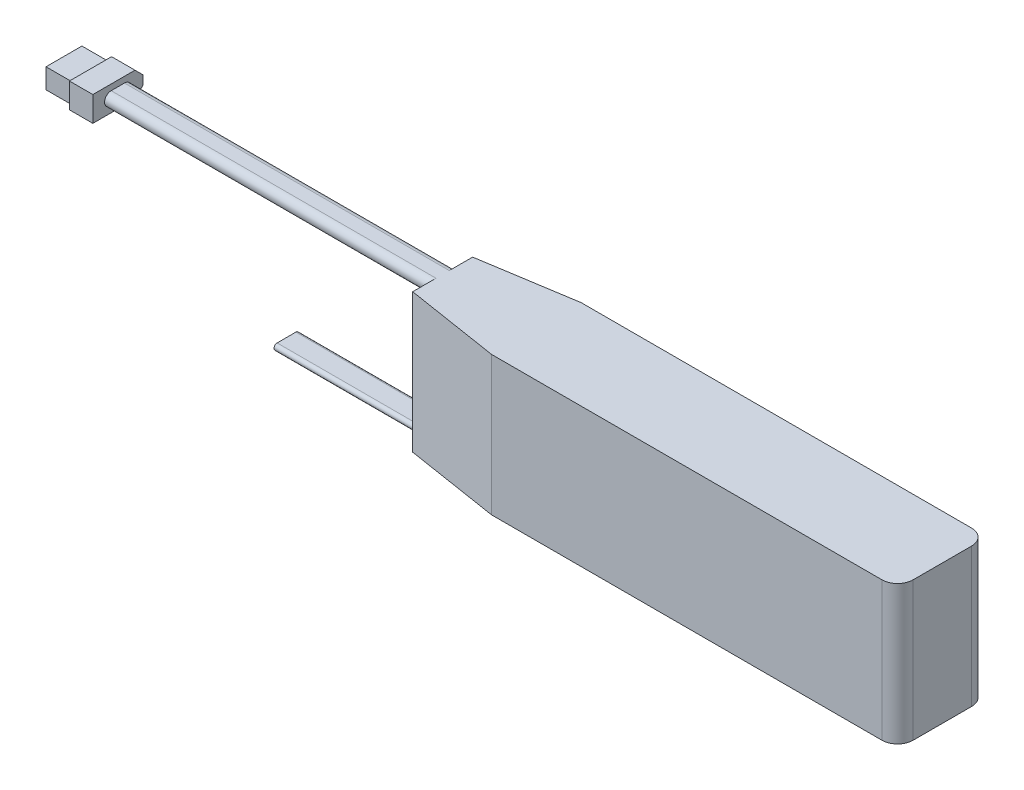
ISO-10303-21;
HEADER;
FILE_DESCRIPTION(('STEP AP214'),'2;1');
FILE_NAME('part.step','',(''),(''),'','','');
FILE_SCHEMA(('AUTOMOTIVE_DESIGN { 1 0 10303 214 1 1 1 1 }'));
ENDSEC;
DATA;
#1=APPLICATION_CONTEXT('core data for automotive mechanical design processes');
#2=APPLICATION_PROTOCOL_DEFINITION('international standard','automotive_design',2000,#1);
#3=PRODUCT_CONTEXT('',#1,'mechanical');
#4=PRODUCT('Part','Part','',(#3));
#5=PRODUCT_RELATED_PRODUCT_CATEGORY('part','',(#4));
#6=PRODUCT_DEFINITION_FORMATION('','',#4);
#7=PRODUCT_DEFINITION_CONTEXT('part definition',#1,'design');
#8=PRODUCT_DEFINITION('design','',#6,#7);
#9=PRODUCT_DEFINITION_SHAPE('','',#8);
#10=(LENGTH_UNIT() NAMED_UNIT(*) SI_UNIT(.MILLI.,.METRE.));
#11=(NAMED_UNIT(*) PLANE_ANGLE_UNIT() SI_UNIT($,.RADIAN.));
#12=(NAMED_UNIT(*) SI_UNIT($,.STERADIAN.) SOLID_ANGLE_UNIT());
#13=UNCERTAINTY_MEASURE_WITH_UNIT(LENGTH_MEASURE(1.E-05),#10,'distance_accuracy_value','');
#14=(GEOMETRIC_REPRESENTATION_CONTEXT(3) GLOBAL_UNCERTAINTY_ASSIGNED_CONTEXT((#13)) GLOBAL_UNIT_ASSIGNED_CONTEXT((#10,
#11,#12)) REPRESENTATION_CONTEXT('',''));
#15=CARTESIAN_POINT('',(0.,0.,0.));
#16=DIRECTION('',(0.,0.,1.));
#17=DIRECTION('',(1.,0.,0.));
#18=AXIS2_PLACEMENT_3D('',#15,#16,#17);
#19=CARTESIAN_POINT('',(-120.,40.25,0.));
#20=DIRECTION('',(0.,1.,0.));
#21=DIRECTION('',(0.,0.,1.));
#22=AXIS2_PLACEMENT_3D('',#19,#20,#21);
#23=PLANE('',#22);
#24=DIRECTION('',(0.,0.,1.));
#25=VECTOR('',#24,1.);
#26=CARTESIAN_POINT('',(-111.5,40.25,0.));
#27=LINE('',#26,#25);
#28=CARTESIAN_POINT('',(-111.5,40.25,14.1166529602516));
#29=VERTEX_POINT('',#28);
#30=CARTESIAN_POINT('',(-111.5,40.25,14.7460280231663));
#31=VERTEX_POINT('',#30);
#32=EDGE_CURVE('E378',#29,#31,#27,.T.);
#33=ORIENTED_EDGE('',*,*,#32,.T.);
#34=DIRECTION('',(-1.,0.,0.));
#35=VECTOR('',#34,1.);
#36=CARTESIAN_POINT('',(-120.,40.25,14.7460280231663));
#37=LINE('',#36,#35);
#38=CARTESIAN_POINT('',(-120.,40.25,14.7460280231663));
#39=VERTEX_POINT('',#38);
#40=EDGE_CURVE('E11',#31,#39,#37,.T.);
#41=ORIENTED_EDGE('',*,*,#40,.T.);
#42=DIRECTION('',(0.,0.,1.));
#43=VECTOR('',#42,1.);
#44=CARTESIAN_POINT('',(-120.,40.25,0.));
#45=LINE('',#44,#43);
#46=CARTESIAN_POINT('',(-120.,40.25,14.1166529602516));
#47=VERTEX_POINT('',#46);
#48=EDGE_CURVE('E262',#47,#39,#45,.T.);
#49=ORIENTED_EDGE('',*,*,#48,.F.);
#50=DIRECTION('',(-1.,0.,0.));
#51=VECTOR('',#50,1.);
#52=CARTESIAN_POINT('',(-120.,40.25,14.1166529602516));
#53=LINE('',#52,#51);
#54=EDGE_CURVE('E41',#29,#47,#53,.T.);
#55=ORIENTED_EDGE('',*,*,#54,.F.);
#56=EDGE_LOOP('',(#33,#41,#49,#55));
#57=FACE_BOUND('',#56,.T.);
#58=ADVANCED_FACE('F33',(#57),#23,.F.);
#59=CARTESIAN_POINT('',(0.,44.5,28.7));
#60=DIRECTION('',(0.,-1.,0.));
#61=DIRECTION('',(0.,0.,-1.));
#62=AXIS2_PLACEMENT_3D('',#59,#60,#61);
#63=PLANE('',#62);
#64=DIRECTION('',(0.,0.,-1.));
#65=VECTOR('',#64,1.);
#66=CARTESIAN_POINT('',(-104.,44.5,28.7));
#67=LINE('',#66,#65);
#68=CARTESIAN_POINT('',(-104.,44.5,16.475));
#69=VERTEX_POINT('',#68);
#70=CARTESIAN_POINT('',(-104.,44.5,12.225));
#71=VERTEX_POINT('',#70);
#72=EDGE_CURVE('E372',#69,#71,#67,.T.);
#73=ORIENTED_EDGE('',*,*,#72,.F.);
#74=DIRECTION('',(1.,0.,0.));
#75=VECTOR('',#74,1.);
#76=CARTESIAN_POINT('',(-120.,44.5,16.475));
#77=LINE('',#76,#75);
#78=CARTESIAN_POINT('',(0.,44.5,16.475));
#79=VERTEX_POINT('',#78);
#80=EDGE_CURVE('E422',#69,#79,#77,.T.);
#81=ORIENTED_EDGE('',*,*,#80,.T.);
#82=DIRECTION('',(0.,0.,-1.));
#83=VECTOR('',#82,1.);
#84=CARTESIAN_POINT('',(0.,44.5,28.7));
#85=LINE('',#84,#83);
#86=CARTESIAN_POINT('',(0.,44.5,23.9484667902639));
#87=VERTEX_POINT('',#86);
#88=EDGE_CURVE('E437',#87,#79,#85,.T.);
#89=ORIENTED_EDGE('',*,*,#88,.F.);
#90=DIRECTION('',(-0.987688340595138,0.,-0.156434465040229));
#91=VECTOR('',#90,1.);
#92=CARTESIAN_POINT('',(30.0000000000007,44.5,28.7));
#93=LINE('',#92,#91);
#94=CARTESIAN_POINT('',(30.0000000000007,44.5,28.7));
#95=VERTEX_POINT('',#94);
#96=EDGE_CURVE('E485',#87,#95,#93,.F.);
#97=ORIENTED_EDGE('',*,*,#96,.T.);
#98=DIRECTION('',(-1.,0.,0.));
#99=VECTOR('',#98,1.);
#100=CARTESIAN_POINT('',(0.,44.5,28.7));
#101=LINE('',#100,#99);
#102=CARTESIAN_POINT('',(155.,44.5,28.7));
#103=VERTEX_POINT('',#102);
#104=EDGE_CURVE('E429',#103,#95,#101,.T.);
#105=ORIENTED_EDGE('',*,*,#104,.F.);
#106=CARTESIAN_POINT('',(155.,44.5,23.7));
#107=DIRECTION('',(0.,-1.,0.));
#108=DIRECTION('',(0.,0.,-1.));
#109=AXIS2_PLACEMENT_3D('',#106,#107,#108);
#110=CIRCLE('',#109,5.);
#111=CARTESIAN_POINT('',(160.,44.5,23.7));
#112=VERTEX_POINT('',#111);
#113=EDGE_CURVE('E455',#103,#112,#110,.F.);
#114=ORIENTED_EDGE('',*,*,#113,.T.);
#115=DIRECTION('',(0.,0.,-1.));
#116=VECTOR('',#115,1.);
#117=CARTESIAN_POINT('',(160.,44.5,28.7));
#118=LINE('',#117,#116);
#119=CARTESIAN_POINT('',(160.,44.5,5.));
#120=VERTEX_POINT('',#119);
#121=EDGE_CURVE('E440',#112,#120,#118,.T.);
#122=ORIENTED_EDGE('',*,*,#121,.T.);
#123=CARTESIAN_POINT('',(155.,44.5,5.));
#124=DIRECTION('',(0.,-1.,0.));
#125=DIRECTION('',(0.,0.,-1.));
#126=AXIS2_PLACEMENT_3D('',#123,#124,#125);
#127=CIRCLE('',#126,5.);
#128=CARTESIAN_POINT('',(155.,44.5,0.));
#129=VERTEX_POINT('',#128);
#130=EDGE_CURVE('E457',#120,#129,#127,.F.);
#131=ORIENTED_EDGE('',*,*,#130,.T.);
#132=DIRECTION('',(-1.,0.,0.));
#133=VECTOR('',#132,1.);
#134=CARTESIAN_POINT('',(0.,44.5,0.));
#135=LINE('',#134,#133);
#136=CARTESIAN_POINT('',(30.0000000000006,44.5,0.));
#137=VERTEX_POINT('',#136);
#138=EDGE_CURVE('E430',#129,#137,#135,.T.);
#139=ORIENTED_EDGE('',*,*,#138,.T.);
#140=DIRECTION('',(-0.987688340595138,0.,0.156434465040229));
#141=VECTOR('',#140,1.);
#142=CARTESIAN_POINT('',(0.,44.5,4.75153320973612));
#143=LINE('',#142,#141);
#144=CARTESIAN_POINT('',(0.,44.5,4.75153320973612));
#145=VERTEX_POINT('',#144);
#146=EDGE_CURVE('E482',#137,#145,#143,.T.);
#147=ORIENTED_EDGE('',*,*,#146,.T.);
#148=CARTESIAN_POINT('',(0.,44.5,12.225));
#149=VERTEX_POINT('',#148);
#150=EDGE_CURVE('E433',#149,#145,#85,.T.);
#151=ORIENTED_EDGE('',*,*,#150,.F.);
#152=DIRECTION('',(1.,0.,0.));
#153=VECTOR('',#152,1.);
#154=CARTESIAN_POINT('',(-120.,44.5,12.225));
#155=LINE('',#154,#153);
#156=EDGE_CURVE('E420',#71,#149,#155,.T.);
#157=ORIENTED_EDGE('',*,*,#156,.F.);
#158=EDGE_LOOP('',(#73,#81,#89,#97,#105,#114,#122,#131,#139,#147,#151,#157));
#159=FACE_BOUND('',#158,.T.);
#160=ADVANCED_FACE('F529',(#159),#63,.F.);
#161=DIRECTION('',(0.,0.,1.));
#162=VECTOR('',#161,1.);
#163=CARTESIAN_POINT('',(-104.,40.25,0.));
#164=LINE('',#163,#162);
#165=CARTESIAN_POINT('',(-104.,40.25,12.225));
#166=VERTEX_POINT('',#165);
#167=CARTESIAN_POINT('',(-104.,40.25,16.475));
#168=VERTEX_POINT('',#167);
#169=EDGE_CURVE('E370',#166,#168,#164,.T.);
#170=ORIENTED_EDGE('',*,*,#169,.F.);
#171=DIRECTION('',(1.,0.,0.));
#172=VECTOR('',#171,1.);
#173=CARTESIAN_POINT('',(-120.,40.25,12.225));
#174=LINE('',#173,#172);
#175=CARTESIAN_POINT('',(0.,40.25,12.225));
#176=VERTEX_POINT('',#175);
#177=EDGE_CURVE('E410',#166,#176,#174,.T.);
#178=ORIENTED_EDGE('',*,*,#177,.T.);
#179=DIRECTION('',(0.,0.,1.));
#180=VECTOR('',#179,1.);
#181=CARTESIAN_POINT('',(0.,40.25,0.));
#182=LINE('',#181,#180);
#183=CARTESIAN_POINT('',(0.,40.25,16.475));
#184=VERTEX_POINT('',#183);
#185=EDGE_CURVE('E408',#176,#184,#182,.T.);
#186=ORIENTED_EDGE('',*,*,#185,.T.);
#187=DIRECTION('',(1.,0.,0.));
#188=VECTOR('',#187,1.);
#189=CARTESIAN_POINT('',(-120.,40.25,16.475));
#190=LINE('',#189,#188);
#191=EDGE_CURVE('E424',#168,#184,#190,.T.);
#192=ORIENTED_EDGE('',*,*,#191,.F.);
#193=EDGE_LOOP('',(#170,#178,#186,#192));
#194=FACE_BOUND('',#193,.T.);
#195=ADVANCED_FACE('F531',(#194),#23,.F.);
#196=CARTESIAN_POINT('',(-120.,42.375,16.475));
#197=DIRECTION('',(1.,0.,0.));
#198=DIRECTION('',(0.,0.,-1.));
#199=AXIS2_PLACEMENT_3D('',#196,#197,#198);
#200=CYLINDRICAL_SURFACE('',#199,2.125);
#201=CARTESIAN_POINT('',(-104.,42.375,16.475));
#202=DIRECTION('',(-1.,0.,0.));
#203=DIRECTION('',(0.,0.,1.));
#204=AXIS2_PLACEMENT_3D('',#201,#202,#203);
#205=CIRCLE('',#204,2.125);
#206=EDGE_CURVE('E375',#168,#69,#205,.T.);
#207=ORIENTED_EDGE('',*,*,#206,.F.);
#208=ORIENTED_EDGE('',*,*,#191,.T.);
#209=CARTESIAN_POINT('',(0.,42.375,16.475));
#210=DIRECTION('',(-1.,0.,0.));
#211=DIRECTION('',(0.,0.,1.));
#212=AXIS2_PLACEMENT_3D('',#209,#210,#211);
#213=CIRCLE('',#212,2.125);
#214=EDGE_CURVE('E414',#184,#79,#213,.T.);
#215=ORIENTED_EDGE('',*,*,#214,.T.);
#216=ORIENTED_EDGE('',*,*,#80,.F.);
#217=EDGE_LOOP('',(#207,#208,#215,#216));
#218=FACE_BOUND('',#217,.T.);
#219=ADVANCED_FACE('F540',(#218),#200,.T.);
#220=CARTESIAN_POINT('',(-120.,42.375,12.225));
#221=DIRECTION('',(1.,0.,0.));
#222=DIRECTION('',(0.,0.,-1.));
#223=AXIS2_PLACEMENT_3D('',#220,#221,#222);
#224=CYLINDRICAL_SURFACE('',#223,2.125);
#225=CARTESIAN_POINT('',(-104.,42.375,12.225));
#226=DIRECTION('',(-1.,0.,0.));
#227=DIRECTION('',(0.,0.,1.));
#228=AXIS2_PLACEMENT_3D('',#225,#226,#227);
#229=CIRCLE('',#228,2.125);
#230=EDGE_CURVE('E489',#71,#166,#229,.T.);
#231=ORIENTED_EDGE('',*,*,#230,.F.);
#232=ORIENTED_EDGE('',*,*,#156,.T.);
#233=CARTESIAN_POINT('',(0.,42.375,12.225));
#234=DIRECTION('',(-1.,0.,0.));
#235=DIRECTION('',(0.,0.,1.));
#236=AXIS2_PLACEMENT_3D('',#233,#234,#235);
#237=CIRCLE('',#236,2.125);
#238=EDGE_CURVE('E411',#149,#176,#237,.T.);
#239=ORIENTED_EDGE('',*,*,#238,.T.);
#240=ORIENTED_EDGE('',*,*,#177,.F.);
#241=EDGE_LOOP('',(#231,#232,#239,#240));
#242=FACE_BOUND('',#241,.T.);
#243=ADVANCED_FACE('F545',(#242),#224,.T.);
#244=CARTESIAN_POINT('',(0.,0.,28.7));
#245=DIRECTION('',(1.,0.,0.));
#246=DIRECTION('',(0.,0.,-1.));
#247=AXIS2_PLACEMENT_3D('',#244,#245,#246);
#248=PLANE('',#247);
#249=CARTESIAN_POINT('',(0.,1.,17.35));
#250=DIRECTION('',(-1.,0.,0.));
#251=DIRECTION('',(0.,0.,1.));
#252=AXIS2_PLACEMENT_3D('',#249,#250,#251);
#253=CIRCLE('',#252,1.);
#254=CARTESIAN_POINT('',(0.,0.,17.35));
#255=VERTEX_POINT('',#254);
#256=CARTESIAN_POINT('',(0.,2.,17.35));
#257=VERTEX_POINT('',#256);
#258=EDGE_CURVE('E381',#255,#257,#253,.T.);
#259=ORIENTED_EDGE('',*,*,#258,.F.);
#260=DIRECTION('',(0.,0.,-1.));
#261=VECTOR('',#260,1.);
#262=CARTESIAN_POINT('',(0.,0.,28.7));
#263=LINE('',#262,#261);
#264=CARTESIAN_POINT('',(0.,0.,23.9484667902639));
#265=VERTEX_POINT('',#264);
#266=EDGE_CURVE('E447',#265,#255,#263,.T.);
#267=ORIENTED_EDGE('',*,*,#266,.F.);
#268=DIRECTION('',(0.,1.,0.));
#269=VECTOR('',#268,1.);
#270=CARTESIAN_POINT('',(0.,0.,23.9484667902639));
#271=LINE('',#270,#269);
#272=EDGE_CURVE('E480',#265,#87,#271,.T.);
#273=ORIENTED_EDGE('',*,*,#272,.T.);
#274=ORIENTED_EDGE('',*,*,#88,.T.);
#275=ORIENTED_EDGE('',*,*,#214,.F.);
#276=ORIENTED_EDGE('',*,*,#185,.F.);
#277=ORIENTED_EDGE('',*,*,#238,.F.);
#278=ORIENTED_EDGE('',*,*,#150,.T.);
#279=DIRECTION('',(0.,-1.,0.));
#280=VECTOR('',#279,1.);
#281=CARTESIAN_POINT('',(0.,0.,4.75153320973612));
#282=LINE('',#281,#280);
#283=CARTESIAN_POINT('',(0.,0.,4.75153320973612));
#284=VERTEX_POINT('',#283);
#285=EDGE_CURVE('E477',#145,#284,#282,.T.);
#286=ORIENTED_EDGE('',*,*,#285,.T.);
#287=CARTESIAN_POINT('',(0.,0.,11.35));
#288=VERTEX_POINT('',#287);
#289=EDGE_CURVE('E446',#288,#284,#263,.T.);
#290=ORIENTED_EDGE('',*,*,#289,.F.);
#291=CARTESIAN_POINT('',(0.,1.,11.35));
#292=DIRECTION('',(-1.,0.,0.));
#293=DIRECTION('',(0.,0.,1.));
#294=AXIS2_PLACEMENT_3D('',#291,#292,#293);
#295=CIRCLE('',#294,1.);
#296=CARTESIAN_POINT('',(0.,2.,11.35));
#297=VERTEX_POINT('',#296);
#298=EDGE_CURVE('E386',#297,#288,#295,.T.);
#299=ORIENTED_EDGE('',*,*,#298,.F.);
#300=DIRECTION('',(0.,0.,1.));
#301=VECTOR('',#300,1.);
#302=CARTESIAN_POINT('',(0.,2.,0.));
#303=LINE('',#302,#301);
#304=EDGE_CURVE('E396',#297,#257,#303,.T.);
#305=ORIENTED_EDGE('',*,*,#304,.T.);
#306=EDGE_LOOP('',(#259,#267,#273,#274,#275,#276,#277,#278,#286,#290,#299,#305));
#307=FACE_BOUND('',#306,.T.);
#308=ADVANCED_FACE('F563',(#307),#248,.F.);
#309=CARTESIAN_POINT('',(0.,0.,28.7));
#310=DIRECTION('',(0.,1.,0.));
#311=DIRECTION('',(0.,0.,1.));
#312=AXIS2_PLACEMENT_3D('',#309,#310,#311);
#313=PLANE('',#312);
#314=DIRECTION('',(1.,0.,0.));
#315=VECTOR('',#314,1.);
#316=CARTESIAN_POINT('',(0.,0.,28.7));
#317=LINE('',#316,#315);
#318=CARTESIAN_POINT('',(30.0000000000007,0.,28.7));
#319=VERTEX_POINT('',#318);
#320=CARTESIAN_POINT('',(155.,0.,28.7));
#321=VERTEX_POINT('',#320);
#322=EDGE_CURVE('E427',#319,#321,#317,.T.);
#323=ORIENTED_EDGE('',*,*,#322,.F.);
#324=DIRECTION('',(0.987688340595138,0.,0.156434465040229));
#325=VECTOR('',#324,1.);
#326=CARTESIAN_POINT('',(30.0000000000007,0.,28.7));
#327=LINE('',#326,#325);
#328=EDGE_CURVE('E475',#319,#265,#327,.F.);
#329=ORIENTED_EDGE('',*,*,#328,.T.);
#330=ORIENTED_EDGE('',*,*,#266,.T.);
#331=DIRECTION('',(1.,0.,0.));
#332=VECTOR('',#331,1.);
#333=CARTESIAN_POINT('',(-50.,0.,17.35));
#334=LINE('',#333,#332);
#335=CARTESIAN_POINT('',(-50.,0.,17.35));
#336=VERTEX_POINT('',#335);
#337=EDGE_CURVE('E406',#336,#255,#334,.T.);
#338=ORIENTED_EDGE('',*,*,#337,.F.);
#339=DIRECTION('',(0.,0.,1.));
#340=VECTOR('',#339,1.);
#341=CARTESIAN_POINT('',(-50.,0.,0.));
#342=LINE('',#341,#340);
#343=CARTESIAN_POINT('',(-50.,0.,11.35));
#344=VERTEX_POINT('',#343);
#345=EDGE_CURVE('E382',#344,#336,#342,.T.);
#346=ORIENTED_EDGE('',*,*,#345,.F.);
#347=DIRECTION('',(1.,0.,0.));
#348=VECTOR('',#347,1.);
#349=CARTESIAN_POINT('',(-50.,0.,11.35));
#350=LINE('',#349,#348);
#351=EDGE_CURVE('E393',#344,#288,#350,.T.);
#352=ORIENTED_EDGE('',*,*,#351,.T.);
#353=ORIENTED_EDGE('',*,*,#289,.T.);
#354=DIRECTION('',(0.987688340595138,0.,-0.156434465040229));
#355=VECTOR('',#354,1.);
#356=CARTESIAN_POINT('',(0.,0.,4.75153320973612));
#357=LINE('',#356,#355);
#358=CARTESIAN_POINT('',(30.0000000000006,0.,0.));
#359=VERTEX_POINT('',#358);
#360=EDGE_CURVE('E473',#284,#359,#357,.T.);
#361=ORIENTED_EDGE('',*,*,#360,.T.);
#362=DIRECTION('',(1.,0.,0.));
#363=VECTOR('',#362,1.);
#364=CARTESIAN_POINT('',(0.,0.,0.));
#365=LINE('',#364,#363);
#366=CARTESIAN_POINT('',(155.,0.,0.));
#367=VERTEX_POINT('',#366);
#368=EDGE_CURVE('E426',#359,#367,#365,.T.);
#369=ORIENTED_EDGE('',*,*,#368,.T.);
#370=CARTESIAN_POINT('',(155.,0.,5.));
#371=DIRECTION('',(0.,1.,0.));
#372=DIRECTION('',(0.,0.,1.));
#373=AXIS2_PLACEMENT_3D('',#370,#371,#372);
#374=CIRCLE('',#373,5.);
#375=CARTESIAN_POINT('',(160.,0.,5.));
#376=VERTEX_POINT('',#375);
#377=EDGE_CURVE('E465',#367,#376,#374,.F.);
#378=ORIENTED_EDGE('',*,*,#377,.T.);
#379=DIRECTION('',(0.,0.,-1.));
#380=VECTOR('',#379,1.);
#381=CARTESIAN_POINT('',(160.,0.,28.7));
#382=LINE('',#381,#380);
#383=CARTESIAN_POINT('',(160.,0.,23.7));
#384=VERTEX_POINT('',#383);
#385=EDGE_CURVE('E443',#384,#376,#382,.T.);
#386=ORIENTED_EDGE('',*,*,#385,.F.);
#387=CARTESIAN_POINT('',(155.,0.,23.7));
#388=DIRECTION('',(0.,1.,0.));
#389=DIRECTION('',(0.,0.,1.));
#390=AXIS2_PLACEMENT_3D('',#387,#388,#389);
#391=CIRCLE('',#390,5.);
#392=EDGE_CURVE('E462',#384,#321,#391,.F.);
#393=ORIENTED_EDGE('',*,*,#392,.T.);
#394=EDGE_LOOP('',(#323,#329,#330,#338,#346,#352,#353,#361,#369,#378,#386,#393));
#395=FACE_BOUND('',#394,.T.);
#396=ADVANCED_FACE('F577',(#395),#313,.F.);
#397=CARTESIAN_POINT('',(160.,0.,28.7));
#398=DIRECTION('',(-1.,0.,0.));
#399=DIRECTION('',(0.,0.,1.));
#400=AXIS2_PLACEMENT_3D('',#397,#398,#399);
#401=PLANE('',#400);
#402=ORIENTED_EDGE('',*,*,#385,.T.);
#403=DIRECTION('',(0.,1.,0.));
#404=VECTOR('',#403,1.);
#405=CARTESIAN_POINT('',(160.,44.5,5.));
#406=LINE('',#405,#404);
#407=EDGE_CURVE('E452',#376,#120,#406,.T.);
#408=ORIENTED_EDGE('',*,*,#407,.T.);
#409=ORIENTED_EDGE('',*,*,#121,.F.);
#410=DIRECTION('',(0.,1.,0.));
#411=VECTOR('',#410,1.);
#412=CARTESIAN_POINT('',(160.,0.,23.7));
#413=LINE('',#412,#411);
#414=EDGE_CURVE('E450',#112,#384,#413,.F.);
#415=ORIENTED_EDGE('',*,*,#414,.T.);
#416=EDGE_LOOP('',(#402,#408,#409,#415));
#417=FACE_BOUND('',#416,.T.);
#418=ADVANCED_FACE('F587',(#417),#401,.F.);
#419=CARTESIAN_POINT('',(0.,0.,28.7));
#420=DIRECTION('',(0.,0.,-1.));
#421=DIRECTION('',(-1.,0.,0.));
#422=AXIS2_PLACEMENT_3D('',#419,#420,#421);
#423=PLANE('',#422);
#424=ORIENTED_EDGE('',*,*,#104,.T.);
#425=DIRECTION('',(0.,-1.,0.));
#426=VECTOR('',#425,1.);
#427=CARTESIAN_POINT('',(30.0000000000007,0.,28.7));
#428=LINE('',#427,#426);
#429=EDGE_CURVE('E470',#95,#319,#428,.T.);
#430=ORIENTED_EDGE('',*,*,#429,.T.);
#431=ORIENTED_EDGE('',*,*,#322,.T.);
#432=DIRECTION('',(0.,1.,0.));
#433=VECTOR('',#432,1.);
#434=CARTESIAN_POINT('',(155.,0.,28.7));
#435=LINE('',#434,#433);
#436=EDGE_CURVE('E467',#321,#103,#435,.T.);
#437=ORIENTED_EDGE('',*,*,#436,.T.);
#438=EDGE_LOOP('',(#424,#430,#431,#437));
#439=FACE_BOUND('',#438,.T.);
#440=ADVANCED_FACE('F575',(#439),#423,.F.);
#441=CARTESIAN_POINT('',(0.,0.,0.));
#442=DIRECTION('',(0.,0.,-1.));
#443=DIRECTION('',(-1.,0.,0.));
#444=AXIS2_PLACEMENT_3D('',#441,#442,#443);
#445=PLANE('',#444);
#446=ORIENTED_EDGE('',*,*,#368,.F.);
#447=DIRECTION('',(0.,1.,0.));
#448=VECTOR('',#447,1.);
#449=CARTESIAN_POINT('',(30.0000000000006,44.5,0.));
#450=LINE('',#449,#448);
#451=EDGE_CURVE('E487',#359,#137,#450,.T.);
#452=ORIENTED_EDGE('',*,*,#451,.T.);
#453=ORIENTED_EDGE('',*,*,#138,.F.);
#454=DIRECTION('',(0.,1.,0.));
#455=VECTOR('',#454,1.);
#456=CARTESIAN_POINT('',(155.,0.,0.));
#457=LINE('',#456,#455);
#458=EDGE_CURVE('E459',#129,#367,#457,.F.);
#459=ORIENTED_EDGE('',*,*,#458,.T.);
#460=EDGE_LOOP('',(#446,#452,#453,#459));
#461=FACE_BOUND('',#460,.T.);
#462=ADVANCED_FACE('F596',(#461),#445,.T.);
#463=CARTESIAN_POINT('',(155.,0.,5.));
#464=DIRECTION('',(0.,-1.,0.));
#465=DIRECTION('',(0.,0.,-1.));
#466=AXIS2_PLACEMENT_3D('',#463,#464,#465);
#467=CYLINDRICAL_SURFACE('',#466,5.);
#468=ORIENTED_EDGE('',*,*,#377,.F.);
#469=ORIENTED_EDGE('',*,*,#458,.F.);
#470=ORIENTED_EDGE('',*,*,#130,.F.);
#471=ORIENTED_EDGE('',*,*,#407,.F.);
#472=EDGE_LOOP('',(#468,#469,#470,#471));
#473=FACE_BOUND('',#472,.T.);
#474=ADVANCED_FACE('F591',(#473),#467,.T.);
#475=CARTESIAN_POINT('',(155.,0.,23.7));
#476=DIRECTION('',(0.,1.,0.));
#477=DIRECTION('',(0.,0.,1.));
#478=AXIS2_PLACEMENT_3D('',#475,#476,#477);
#479=CYLINDRICAL_SURFACE('',#478,5.);
#480=ORIENTED_EDGE('',*,*,#392,.F.);
#481=ORIENTED_EDGE('',*,*,#414,.F.);
#482=ORIENTED_EDGE('',*,*,#113,.F.);
#483=ORIENTED_EDGE('',*,*,#436,.F.);
#484=EDGE_LOOP('',(#480,#481,#482,#483));
#485=FACE_BOUND('',#484,.T.);
#486=ADVANCED_FACE('F584',(#485),#479,.T.);
#487=CARTESIAN_POINT('',(30.0000000000007,0.,28.7));
#488=DIRECTION('',(0.156434465040229,0.,-0.987688340595138));
#489=DIRECTION('',(0.,-1.,0.));
#490=AXIS2_PLACEMENT_3D('',#487,#488,#489);
#491=PLANE('',#490);
#492=ORIENTED_EDGE('',*,*,#96,.F.);
#493=ORIENTED_EDGE('',*,*,#272,.F.);
#494=ORIENTED_EDGE('',*,*,#328,.F.);
#495=ORIENTED_EDGE('',*,*,#429,.F.);
#496=EDGE_LOOP('',(#492,#493,#494,#495));
#497=FACE_BOUND('',#496,.T.);
#498=ADVANCED_FACE('F572',(#497),#491,.F.);
#499=CARTESIAN_POINT('',(0.,0.,4.75153320973612));
#500=DIRECTION('',(-0.156434465040229,0.,-0.987688340595138));
#501=DIRECTION('',(0.,1.,0.));
#502=AXIS2_PLACEMENT_3D('',#499,#500,#501);
#503=PLANE('',#502);
#504=ORIENTED_EDGE('',*,*,#146,.F.);
#505=ORIENTED_EDGE('',*,*,#451,.F.);
#506=ORIENTED_EDGE('',*,*,#360,.F.);
#507=ORIENTED_EDGE('',*,*,#285,.F.);
#508=EDGE_LOOP('',(#504,#505,#506,#507));
#509=FACE_BOUND('',#508,.T.);
#510=ADVANCED_FACE('F35',(#509),#503,.T.);
#511=CARTESIAN_POINT('',(-50.,1.,17.35));
#512=DIRECTION('',(1.,0.,0.));
#513=DIRECTION('',(0.,0.,-1.));
#514=AXIS2_PLACEMENT_3D('',#511,#512,#513);
#515=CYLINDRICAL_SURFACE('',#514,1.);
#516=ORIENTED_EDGE('',*,*,#258,.T.);
#517=DIRECTION('',(1.,0.,0.));
#518=VECTOR('',#517,1.);
#519=CARTESIAN_POINT('',(-50.,2.,17.35));
#520=LINE('',#519,#518);
#521=CARTESIAN_POINT('',(-50.,2.,17.35));
#522=VERTEX_POINT('',#521);
#523=EDGE_CURVE('E404',#522,#257,#520,.T.);
#524=ORIENTED_EDGE('',*,*,#523,.F.);
#525=CARTESIAN_POINT('',(-50.,1.,17.35));
#526=DIRECTION('',(-1.,0.,0.));
#527=DIRECTION('',(0.,0.,1.));
#528=AXIS2_PLACEMENT_3D('',#525,#526,#527);
#529=CIRCLE('',#528,1.);
#530=EDGE_CURVE('E385',#336,#522,#529,.T.);
#531=ORIENTED_EDGE('',*,*,#530,.F.);
#532=ORIENTED_EDGE('',*,*,#337,.T.);
#533=EDGE_LOOP('',(#516,#524,#531,#532));
#534=FACE_BOUND('',#533,.T.);
#535=ADVANCED_FACE('F612',(#534),#515,.T.);
#536=CARTESIAN_POINT('',(-50.,2.,0.));
#537=DIRECTION('',(0.,1.,0.));
#538=DIRECTION('',(0.,0.,1.));
#539=AXIS2_PLACEMENT_3D('',#536,#537,#538);
#540=PLANE('',#539);
#541=ORIENTED_EDGE('',*,*,#304,.F.);
#542=DIRECTION('',(1.,0.,0.));
#543=VECTOR('',#542,1.);
#544=CARTESIAN_POINT('',(-50.,2.,11.35));
#545=LINE('',#544,#543);
#546=CARTESIAN_POINT('',(-50.,2.,11.35));
#547=VERTEX_POINT('',#546);
#548=EDGE_CURVE('E402',#547,#297,#545,.T.);
#549=ORIENTED_EDGE('',*,*,#548,.F.);
#550=DIRECTION('',(0.,0.,1.));
#551=VECTOR('',#550,1.);
#552=CARTESIAN_POINT('',(-50.,2.,0.));
#553=LINE('',#552,#551);
#554=EDGE_CURVE('E388',#547,#522,#553,.T.);
#555=ORIENTED_EDGE('',*,*,#554,.T.);
#556=ORIENTED_EDGE('',*,*,#523,.T.);
#557=EDGE_LOOP('',(#541,#549,#555,#556));
#558=FACE_BOUND('',#557,.T.);
#559=ADVANCED_FACE('F609',(#558),#540,.T.);
#560=CARTESIAN_POINT('',(-50.,1.,11.35));
#561=DIRECTION('',(1.,0.,0.));
#562=DIRECTION('',(0.,0.,-1.));
#563=AXIS2_PLACEMENT_3D('',#560,#561,#562);
#564=CYLINDRICAL_SURFACE('',#563,1.);
#565=ORIENTED_EDGE('',*,*,#298,.T.);
#566=ORIENTED_EDGE('',*,*,#351,.F.);
#567=CARTESIAN_POINT('',(-50.,1.,11.35));
#568=DIRECTION('',(-1.,0.,0.));
#569=DIRECTION('',(0.,0.,1.));
#570=AXIS2_PLACEMENT_3D('',#567,#568,#569);
#571=CIRCLE('',#570,1.);
#572=EDGE_CURVE('E391',#547,#344,#571,.T.);
#573=ORIENTED_EDGE('',*,*,#572,.F.);
#574=ORIENTED_EDGE('',*,*,#548,.T.);
#575=EDGE_LOOP('',(#565,#566,#573,#574));
#576=FACE_BOUND('',#575,.T.);
#577=ADVANCED_FACE('F605',(#576),#564,.T.);
#578=CARTESIAN_POINT('',(-50.,0.,0.));
#579=DIRECTION('',(-1.,0.,0.));
#580=DIRECTION('',(0.,0.,1.));
#581=AXIS2_PLACEMENT_3D('',#578,#579,#580);
#582=PLANE('',#581);
#583=ORIENTED_EDGE('',*,*,#345,.T.);
#584=ORIENTED_EDGE('',*,*,#530,.T.);
#585=ORIENTED_EDGE('',*,*,#554,.F.);
#586=ORIENTED_EDGE('',*,*,#572,.T.);
#587=EDGE_LOOP('',(#583,#584,#585,#586));
#588=FACE_BOUND('',#587,.T.);
#589=ADVANCED_FACE('F615',(#588),#582,.T.);
#590=CARTESIAN_POINT('',(-111.5,0.,6.35000000000001));
#591=DIRECTION('',(0.,0.,1.));
#592=DIRECTION('',(0.,-1.,0.));
#593=AXIS2_PLACEMENT_3D('',#590,#591,#592);
#594=PLANE('',#593);
#595=DIRECTION('',(0.,-1.,0.));
#596=VECTOR('',#595,1.);
#597=CARTESIAN_POINT('',(-104.,0.,6.35000000000001));
#598=LINE('',#597,#596);
#599=CARTESIAN_POINT('',(-104.,43.875,6.35));
#600=VERTEX_POINT('',#599);
#601=CARTESIAN_POINT('',(-104.,40.875,6.35));
#602=VERTEX_POINT('',#601);
#603=EDGE_CURVE('E323',#600,#602,#598,.T.);
#604=ORIENTED_EDGE('',*,*,#603,.T.);
#605=DIRECTION('',(1.,0.,0.));
#606=VECTOR('',#605,1.);
#607=CARTESIAN_POINT('',(-111.5,40.875,6.35));
#608=LINE('',#607,#606);
#609=CARTESIAN_POINT('',(-111.5,40.875,6.35));
#610=VERTEX_POINT('',#609);
#611=EDGE_CURVE('E367',#610,#602,#608,.T.);
#612=ORIENTED_EDGE('',*,*,#611,.F.);
#613=DIRECTION('',(0.,-1.,0.));
#614=VECTOR('',#613,1.);
#615=CARTESIAN_POINT('',(-111.5,0.,6.35000000000001));
#616=LINE('',#615,#614);
#617=CARTESIAN_POINT('',(-111.5,43.875,6.35));
#618=VERTEX_POINT('',#617);
#619=EDGE_CURVE('E324',#618,#610,#616,.T.);
#620=ORIENTED_EDGE('',*,*,#619,.F.);
#621=DIRECTION('',(1.,0.,0.));
#622=VECTOR('',#621,1.);
#623=CARTESIAN_POINT('',(-111.5,43.875,6.35));
#624=LINE('',#623,#622);
#625=EDGE_CURVE('E341',#618,#600,#624,.T.);
#626=ORIENTED_EDGE('',*,*,#625,.T.);
#627=EDGE_LOOP('',(#604,#612,#620,#626));
#628=FACE_BOUND('',#627,.T.);
#629=ADVANCED_FACE('F617',(#628),#594,.F.);
#630=CARTESIAN_POINT('',(-111.5,23.6125,23.6125));
#631=DIRECTION('',(0.,0.707106781186547,0.707106781186548));
#632=DIRECTION('',(0.,-0.707106781186548,0.707106781186547));
#633=AXIS2_PLACEMENT_3D('',#630,#631,#632);
#634=PLANE('',#633);
#635=DIRECTION('',(0.,-0.707106781186548,0.707106781186547));
#636=VECTOR('',#635,1.);
#637=CARTESIAN_POINT('',(-104.,23.6125,23.6125));
#638=LINE('',#637,#636);
#639=CARTESIAN_POINT('',(-104.,38.375,8.85));
#640=VERTEX_POINT('',#639);
#641=EDGE_CURVE('E344',#602,#640,#638,.T.);
#642=ORIENTED_EDGE('',*,*,#641,.T.);
#643=DIRECTION('',(1.,0.,0.));
#644=VECTOR('',#643,1.);
#645=CARTESIAN_POINT('',(-111.5,38.375,8.85));
#646=LINE('',#645,#644);
#647=CARTESIAN_POINT('',(-111.5,38.375,8.85));
#648=VERTEX_POINT('',#647);
#649=EDGE_CURVE('E364',#648,#640,#646,.T.);
#650=ORIENTED_EDGE('',*,*,#649,.F.);
#651=DIRECTION('',(0.,-0.707106781186548,0.707106781186547));
#652=VECTOR('',#651,1.);
#653=CARTESIAN_POINT('',(-111.5,23.6125,23.6125));
#654=LINE('',#653,#652);
#655=EDGE_CURVE('E327',#610,#648,#654,.T.);
#656=ORIENTED_EDGE('',*,*,#655,.F.);
#657=ORIENTED_EDGE('',*,*,#611,.T.);
#658=EDGE_LOOP('',(#642,#650,#656,#657));
#659=FACE_BOUND('',#658,.T.);
#660=ADVANCED_FACE('F623',(#659),#634,.F.);
#661=CARTESIAN_POINT('',(-111.5,38.375,0.));
#662=DIRECTION('',(0.,1.,0.));
#663=DIRECTION('',(0.,0.,1.));
#664=AXIS2_PLACEMENT_3D('',#661,#662,#663);
#665=PLANE('',#664);
#666=DIRECTION('',(0.,0.,1.));
#667=VECTOR('',#666,1.);
#668=CARTESIAN_POINT('',(-104.,38.375,0.));
#669=LINE('',#668,#667);
#670=CARTESIAN_POINT('',(-104.,38.375,22.35));
#671=VERTEX_POINT('',#670);
#672=EDGE_CURVE('E346',#640,#671,#669,.T.);
#673=ORIENTED_EDGE('',*,*,#672,.T.);
#674=DIRECTION('',(1.,0.,0.));
#675=VECTOR('',#674,1.);
#676=CARTESIAN_POINT('',(-111.5,38.375,22.35));
#677=LINE('',#676,#675);
#678=CARTESIAN_POINT('',(-111.5,38.375,22.35));
#679=VERTEX_POINT('',#678);
#680=EDGE_CURVE('E362',#679,#671,#677,.T.);
#681=ORIENTED_EDGE('',*,*,#680,.F.);
#682=DIRECTION('',(0.,0.,1.));
#683=VECTOR('',#682,1.);
#684=CARTESIAN_POINT('',(-111.5,38.375,0.));
#685=LINE('',#684,#683);
#686=EDGE_CURVE('E330',#648,#679,#685,.T.);
#687=ORIENTED_EDGE('',*,*,#686,.F.);
#688=ORIENTED_EDGE('',*,*,#649,.T.);
#689=EDGE_LOOP('',(#673,#681,#687,#688));
#690=FACE_BOUND('',#689,.T.);
#691=ADVANCED_FACE('F708',(#690),#665,.F.);
#692=CARTESIAN_POINT('',(-111.5,0.,22.35));
#693=DIRECTION('',(0.,0.,1.));
#694=DIRECTION('',(0.,-1.,0.));
#695=AXIS2_PLACEMENT_3D('',#692,#693,#694);
#696=PLANE('',#695);
#697=DIRECTION('',(0.,-1.,0.));
#698=VECTOR('',#697,1.);
#699=CARTESIAN_POINT('',(-104.,0.,22.35));
#700=LINE('',#699,#698);
#701=CARTESIAN_POINT('',(-104.,46.375,22.35));
#702=VERTEX_POINT('',#701);
#703=EDGE_CURVE('E349',#702,#671,#700,.T.);
#704=ORIENTED_EDGE('',*,*,#703,.F.);
#705=DIRECTION('',(1.,0.,0.));
#706=VECTOR('',#705,1.);
#707=CARTESIAN_POINT('',(-111.5,46.375,22.35));
#708=LINE('',#707,#706);
#709=CARTESIAN_POINT('',(-111.5,46.375,22.35));
#710=VERTEX_POINT('',#709);
#711=EDGE_CURVE('E360',#710,#702,#708,.T.);
#712=ORIENTED_EDGE('',*,*,#711,.F.);
#713=DIRECTION('',(0.,-1.,0.));
#714=VECTOR('',#713,1.);
#715=CARTESIAN_POINT('',(-111.5,0.,22.35));
#716=LINE('',#715,#714);
#717=EDGE_CURVE('E332',#710,#679,#716,.T.);
#718=ORIENTED_EDGE('',*,*,#717,.T.);
#719=ORIENTED_EDGE('',*,*,#680,.T.);
#720=EDGE_LOOP('',(#704,#712,#718,#719));
#721=FACE_BOUND('',#720,.T.);
#722=ADVANCED_FACE('F717',(#721),#696,.T.);
#723=CARTESIAN_POINT('',(-111.5,46.375,0.));
#724=DIRECTION('',(0.,1.,0.));
#725=DIRECTION('',(0.,0.,1.));
#726=AXIS2_PLACEMENT_3D('',#723,#724,#725);
#727=PLANE('',#726);
#728=DIRECTION('',(0.,0.,1.));
#729=VECTOR('',#728,1.);
#730=CARTESIAN_POINT('',(-104.,46.375,0.));
#731=LINE('',#730,#729);
#732=CARTESIAN_POINT('',(-104.,46.375,8.84999999999999));
#733=VERTEX_POINT('',#732);
#734=EDGE_CURVE('E352',#733,#702,#731,.T.);
#735=ORIENTED_EDGE('',*,*,#734,.F.);
#736=DIRECTION('',(1.,0.,0.));
#737=VECTOR('',#736,1.);
#738=CARTESIAN_POINT('',(-111.5,46.375,8.84999999999999));
#739=LINE('',#738,#737);
#740=CARTESIAN_POINT('',(-111.5,46.375,8.84999999999999));
#741=VERTEX_POINT('',#740);
#742=EDGE_CURVE('E358',#741,#733,#739,.T.);
#743=ORIENTED_EDGE('',*,*,#742,.F.);
#744=DIRECTION('',(0.,0.,1.));
#745=VECTOR('',#744,1.);
#746=CARTESIAN_POINT('',(-111.5,46.375,0.));
#747=LINE('',#746,#745);
#748=EDGE_CURVE('E335',#741,#710,#747,.T.);
#749=ORIENTED_EDGE('',*,*,#748,.T.);
#750=ORIENTED_EDGE('',*,*,#711,.T.);
#751=EDGE_LOOP('',(#735,#743,#749,#750));
#752=FACE_BOUND('',#751,.T.);
#753=ADVANCED_FACE('F727',(#752),#727,.T.);
#754=CARTESIAN_POINT('',(-111.5,18.7625,-18.7625));
#755=DIRECTION('',(0.,0.707106781186547,-0.707106781186548));
#756=DIRECTION('',(0.,0.707106781186548,0.707106781186547));
#757=AXIS2_PLACEMENT_3D('',#754,#755,#756);
#758=PLANE('',#757);
#759=DIRECTION('',(0.,0.707106781186548,0.707106781186547));
#760=VECTOR('',#759,1.);
#761=CARTESIAN_POINT('',(-104.,18.7625,-18.7625));
#762=LINE('',#761,#760);
#763=EDGE_CURVE('E328',#600,#733,#762,.T.);
#764=ORIENTED_EDGE('',*,*,#763,.F.);
#765=ORIENTED_EDGE('',*,*,#625,.F.);
#766=DIRECTION('',(0.,0.707106781186548,0.707106781186547));
#767=VECTOR('',#766,1.);
#768=CARTESIAN_POINT('',(-111.5,18.7625,-18.7625));
#769=LINE('',#768,#767);
#770=EDGE_CURVE('E338',#618,#741,#769,.T.);
#771=ORIENTED_EDGE('',*,*,#770,.T.);
#772=ORIENTED_EDGE('',*,*,#742,.T.);
#773=EDGE_LOOP('',(#764,#765,#771,#772));
#774=FACE_BOUND('',#773,.T.);
#775=ADVANCED_FACE('F737',(#774),#758,.T.);
#776=CARTESIAN_POINT('',(-111.5,0.,0.));
#777=DIRECTION('',(-1.,0.,0.));
#778=DIRECTION('',(0.,0.,1.));
#779=AXIS2_PLACEMENT_3D('',#776,#777,#778);
#780=PLANE('',#779);
#781=DIRECTION('',(0.,-1.,0.));
#782=VECTOR('',#781,1.);
#783=CARTESIAN_POINT('',(-111.5,0.,14.7460280231663));
#784=LINE('',#783,#782);
#785=CARTESIAN_POINT('',(-111.5,39.175,14.7460280231663));
#786=VERTEX_POINT('',#785);
#787=EDGE_CURVE('E245',#31,#786,#784,.T.);
#788=ORIENTED_EDGE('',*,*,#787,.F.);
#789=ORIENTED_EDGE('',*,*,#32,.F.);
#790=DIRECTION('',(0.,-1.,0.));
#791=VECTOR('',#790,1.);
#792=CARTESIAN_POINT('',(-111.5,0.,14.1166529602516));
#793=LINE('',#792,#791);
#794=CARTESIAN_POINT('',(-111.5,39.175,14.1166529602516));
#795=VERTEX_POINT('',#794);
#796=EDGE_CURVE('E247',#29,#795,#793,.T.);
#797=ORIENTED_EDGE('',*,*,#796,.T.);
#798=DIRECTION('',(0.,0.,-1.));
#799=VECTOR('',#798,1.);
#800=CARTESIAN_POINT('',(-111.5,39.175,0.));
#801=LINE('',#800,#799);
#802=CARTESIAN_POINT('',(-111.5,39.175,9.85));
#803=VERTEX_POINT('',#802);
#804=EDGE_CURVE('E309',#795,#803,#801,.T.);
#805=ORIENTED_EDGE('',*,*,#804,.T.);
#806=DIRECTION('',(0.,0.707106781186548,-0.707106781186547));
#807=VECTOR('',#806,1.);
#808=CARTESIAN_POINT('',(-111.5,24.5125,24.5125));
#809=LINE('',#808,#807);
#810=CARTESIAN_POINT('',(-111.5,41.675,7.35000000000001));
#811=VERTEX_POINT('',#810);
#812=EDGE_CURVE('E311',#803,#811,#809,.T.);
#813=ORIENTED_EDGE('',*,*,#812,.T.);
#814=DIRECTION('',(0.,1.,0.));
#815=VECTOR('',#814,1.);
#816=CARTESIAN_POINT('',(-111.5,0.,7.35));
#817=LINE('',#816,#815);
#818=CARTESIAN_POINT('',(-111.5,43.075,7.35));
#819=VERTEX_POINT('',#818);
#820=EDGE_CURVE('E313',#811,#819,#817,.T.);
#821=ORIENTED_EDGE('',*,*,#820,.T.);
#822=DIRECTION('',(0.,-0.707106781186548,-0.707106781186547));
#823=VECTOR('',#822,1.);
#824=CARTESIAN_POINT('',(-111.5,17.8625,-17.8625));
#825=LINE('',#824,#823);
#826=CARTESIAN_POINT('',(-111.5,45.575,9.84999999999999));
#827=VERTEX_POINT('',#826);
#828=EDGE_CURVE('E315',#827,#819,#825,.T.);
#829=ORIENTED_EDGE('',*,*,#828,.F.);
#830=DIRECTION('',(0.,0.,-1.));
#831=VECTOR('',#830,1.);
#832=CARTESIAN_POINT('',(-111.5,45.575,0.));
#833=LINE('',#832,#831);
#834=CARTESIAN_POINT('',(-111.5,45.575,21.35));
#835=VERTEX_POINT('',#834);
#836=EDGE_CURVE('E318',#835,#827,#833,.T.);
#837=ORIENTED_EDGE('',*,*,#836,.F.);
#838=DIRECTION('',(0.,1.,0.));
#839=VECTOR('',#838,1.);
#840=CARTESIAN_POINT('',(-111.5,0.,21.35));
#841=LINE('',#840,#839);
#842=CARTESIAN_POINT('',(-111.5,39.175,21.35));
#843=VERTEX_POINT('',#842);
#844=EDGE_CURVE('E53',#843,#835,#841,.T.);
#845=ORIENTED_EDGE('',*,*,#844,.F.);
#846=DIRECTION('',(0.,0.,-1.));
#847=VECTOR('',#846,1.);
#848=CARTESIAN_POINT('',(-111.5,39.175,0.));
#849=LINE('',#848,#847);
#850=EDGE_CURVE('E48',#843,#786,#849,.T.);
#851=ORIENTED_EDGE('',*,*,#850,.T.);
#852=EDGE_LOOP('',(#788,#789,#797,#805,#813,#821,#829,#837,#845,#851));
#853=FACE_BOUND('',#852,.T.);
#854=ORIENTED_EDGE('',*,*,#619,.T.);
#855=ORIENTED_EDGE('',*,*,#655,.T.);
#856=ORIENTED_EDGE('',*,*,#686,.T.);
#857=ORIENTED_EDGE('',*,*,#717,.F.);
#858=ORIENTED_EDGE('',*,*,#748,.F.);
#859=ORIENTED_EDGE('',*,*,#770,.F.);
#860=EDGE_LOOP('',(#854,#855,#856,#857,#858,#859));
#861=FACE_BOUND('',#860,.T.);
#862=ADVANCED_FACE('F503',(#853,#861),#780,.T.);
#863=CARTESIAN_POINT('',(-104.,0.,0.));
#864=DIRECTION('',(-1.,0.,0.));
#865=DIRECTION('',(0.,0.,1.));
#866=AXIS2_PLACEMENT_3D('',#863,#864,#865);
#867=PLANE('',#866);
#868=ORIENTED_EDGE('',*,*,#169,.T.);
#869=ORIENTED_EDGE('',*,*,#206,.T.);
#870=ORIENTED_EDGE('',*,*,#72,.T.);
#871=ORIENTED_EDGE('',*,*,#230,.T.);
#872=EDGE_LOOP('',(#868,#869,#870,#871));
#873=FACE_BOUND('',#872,.T.);
#874=ORIENTED_EDGE('',*,*,#603,.F.);
#875=ORIENTED_EDGE('',*,*,#763,.T.);
#876=ORIENTED_EDGE('',*,*,#734,.T.);
#877=ORIENTED_EDGE('',*,*,#703,.T.);
#878=ORIENTED_EDGE('',*,*,#672,.F.);
#879=ORIENTED_EDGE('',*,*,#641,.F.);
#880=EDGE_LOOP('',(#874,#875,#876,#877,#878,#879));
#881=FACE_BOUND('',#880,.T.);
#882=ADVANCED_FACE('F552',(#873,#881),#867,.F.);
#883=CARTESIAN_POINT('',(-120.,0.,0.));
#884=DIRECTION('',(-1.,0.,0.));
#885=DIRECTION('',(0.,0.,1.));
#886=AXIS2_PLACEMENT_3D('',#883,#884,#885);
#887=PLANE('',#886);
#888=CARTESIAN_POINT('',(-120.,42.375,17.1232509958036));
#889=DIRECTION('',(-1.,0.,0.));
#890=DIRECTION('',(0.,0.,1.));
#891=AXIS2_PLACEMENT_3D('',#888,#889,#890);
#892=CIRCLE('',#891,1.75);
#893=CARTESIAN_POINT('',(-120.,42.375,18.8732509958036));
#894=VERTEX_POINT('',#893);
#895=EDGE_CURVE('E888',#894,#894,#892,.T.);
#896=ORIENTED_EDGE('',*,*,#895,.F.);
#897=EDGE_LOOP('',(#896));
#898=FACE_BOUND('',#897,.T.);
#899=CARTESIAN_POINT('',(-120.,42.375,11.6336743270745));
#900=DIRECTION('',(-1.,0.,0.));
#901=DIRECTION('',(0.,0.,1.));
#902=AXIS2_PLACEMENT_3D('',#899,#900,#901);
#903=CIRCLE('',#902,1.75);
#904=CARTESIAN_POINT('',(-120.,42.375,13.3836743270745));
#905=VERTEX_POINT('',#904);
#906=EDGE_CURVE('E266',#905,#905,#903,.T.);
#907=ORIENTED_EDGE('',*,*,#906,.F.);
#908=EDGE_LOOP('',(#907));
#909=FACE_BOUND('',#908,.T.);
#910=ORIENTED_EDGE('',*,*,#48,.T.);
#911=DIRECTION('',(0.,1.,0.));
#912=VECTOR('',#911,1.);
#913=CARTESIAN_POINT('',(-120.,0.,14.7460280231663));
#914=LINE('',#913,#912);
#915=CARTESIAN_POINT('',(-120.,39.175,14.7460280231663));
#916=VERTEX_POINT('',#915);
#917=EDGE_CURVE('E244',#916,#39,#914,.T.);
#918=ORIENTED_EDGE('',*,*,#917,.F.);
#919=DIRECTION('',(0.,0.,1.));
#920=VECTOR('',#919,1.);
#921=CARTESIAN_POINT('',(-120.,39.175,0.));
#922=LINE('',#921,#920);
#923=CARTESIAN_POINT('',(-120.,39.175,21.35));
#924=VERTEX_POINT('',#923);
#925=EDGE_CURVE('E251',#916,#924,#922,.T.);
#926=ORIENTED_EDGE('',*,*,#925,.T.);
#927=DIRECTION('',(0.,-1.,0.));
#928=VECTOR('',#927,1.);
#929=CARTESIAN_POINT('',(-120.,0.,21.35));
#930=LINE('',#929,#928);
#931=CARTESIAN_POINT('',(-120.,45.575,21.35));
#932=VERTEX_POINT('',#931);
#933=EDGE_CURVE('E257',#932,#924,#930,.T.);
#934=ORIENTED_EDGE('',*,*,#933,.F.);
#935=DIRECTION('',(0.,0.,1.));
#936=VECTOR('',#935,1.);
#937=CARTESIAN_POINT('',(-120.,45.575,0.));
#938=LINE('',#937,#936);
#939=CARTESIAN_POINT('',(-120.,45.575,9.84999999999999));
#940=VERTEX_POINT('',#939);
#941=EDGE_CURVE('E271',#940,#932,#938,.T.);
#942=ORIENTED_EDGE('',*,*,#941,.F.);
#943=DIRECTION('',(0.,0.707106781186548,0.707106781186547));
#944=VECTOR('',#943,1.);
#945=CARTESIAN_POINT('',(-120.,17.8625,-17.8625));
#946=LINE('',#945,#944);
#947=CARTESIAN_POINT('',(-120.,43.075,7.35));
#948=VERTEX_POINT('',#947);
#949=EDGE_CURVE('E274',#948,#940,#946,.T.);
#950=ORIENTED_EDGE('',*,*,#949,.F.);
#951=DIRECTION('',(0.,-1.,0.));
#952=VECTOR('',#951,1.);
#953=CARTESIAN_POINT('',(-120.,0.,7.35));
#954=LINE('',#953,#952);
#955=CARTESIAN_POINT('',(-120.,41.675,7.35));
#956=VERTEX_POINT('',#955);
#957=EDGE_CURVE('E277',#948,#956,#954,.T.);
#958=ORIENTED_EDGE('',*,*,#957,.T.);
#959=DIRECTION('',(0.,-0.707106781186548,0.707106781186547));
#960=VECTOR('',#959,1.);
#961=CARTESIAN_POINT('',(-120.,24.5125,24.5125));
#962=LINE('',#961,#960);
#963=CARTESIAN_POINT('',(-120.,39.175,9.85));
#964=VERTEX_POINT('',#963);
#965=EDGE_CURVE('E280',#956,#964,#962,.T.);
#966=ORIENTED_EDGE('',*,*,#965,.T.);
#967=DIRECTION('',(0.,0.,1.));
#968=VECTOR('',#967,1.);
#969=CARTESIAN_POINT('',(-120.,39.175,0.));
#970=LINE('',#969,#968);
#971=CARTESIAN_POINT('',(-120.,39.175,14.1166529602516));
#972=VERTEX_POINT('',#971);
#973=EDGE_CURVE('E283',#964,#972,#970,.T.);
#974=ORIENTED_EDGE('',*,*,#973,.T.);
#975=DIRECTION('',(0.,1.,0.));
#976=VECTOR('',#975,1.);
#977=CARTESIAN_POINT('',(-120.,0.,14.1166529602516));
#978=LINE('',#977,#976);
#979=EDGE_CURVE('E286',#972,#47,#978,.T.);
#980=ORIENTED_EDGE('',*,*,#979,.T.);
#981=EDGE_LOOP('',(#910,#918,#926,#934,#942,#950,#958,#966,#974,#980));
#982=FACE_BOUND('',#981,.T.);
#983=ADVANCED_FACE('F260',(#898,#909,#982),#887,.T.);
#984=CARTESIAN_POINT('',(-120.,0.,14.7460280231663));
#985=DIRECTION('',(0.,0.,-1.));
#986=DIRECTION('',(-1.,0.,0.));
#987=AXIS2_PLACEMENT_3D('',#984,#985,#986);
#988=PLANE('',#987);
#989=ORIENTED_EDGE('',*,*,#40,.F.);
#990=ORIENTED_EDGE('',*,*,#787,.T.);
#991=DIRECTION('',(1.,0.,0.));
#992=VECTOR('',#991,1.);
#993=CARTESIAN_POINT('',(-120.,39.175,14.7460280231663));
#994=LINE('',#993,#992);
#995=EDGE_CURVE('E239',#916,#786,#994,.T.);
#996=ORIENTED_EDGE('',*,*,#995,.F.);
#997=ORIENTED_EDGE('',*,*,#917,.T.);
#998=EDGE_LOOP('',(#989,#990,#996,#997));
#999=FACE_BOUND('',#998,.T.);
#1000=ADVANCED_FACE('F242',(#999),#988,.T.);
#1001=CARTESIAN_POINT('',(-120.,39.175,0.));
#1002=DIRECTION('',(0.,1.,0.));
#1003=DIRECTION('',(0.,0.,1.));
#1004=AXIS2_PLACEMENT_3D('',#1001,#1002,#1003);
#1005=PLANE('',#1004);
#1006=ORIENTED_EDGE('',*,*,#850,.F.);
#1007=DIRECTION('',(1.,0.,0.));
#1008=VECTOR('',#1007,1.);
#1009=CARTESIAN_POINT('',(-120.,39.175,21.35));
#1010=LINE('',#1009,#1008);
#1011=EDGE_CURVE('E248',#924,#843,#1010,.T.);
#1012=ORIENTED_EDGE('',*,*,#1011,.F.);
#1013=ORIENTED_EDGE('',*,*,#925,.F.);
#1014=ORIENTED_EDGE('',*,*,#995,.T.);
#1015=EDGE_LOOP('',(#1006,#1012,#1013,#1014));
#1016=FACE_BOUND('',#1015,.T.);
#1017=ADVANCED_FACE('F252',(#1016),#1005,.F.);
#1018=CARTESIAN_POINT('',(-120.,0.,21.35));
#1019=DIRECTION('',(0.,0.,1.));
#1020=DIRECTION('',(1.,0.,0.));
#1021=AXIS2_PLACEMENT_3D('',#1018,#1019,#1020);
#1022=PLANE('',#1021);
#1023=ORIENTED_EDGE('',*,*,#1011,.T.);
#1024=ORIENTED_EDGE('',*,*,#844,.T.);
#1025=DIRECTION('',(1.,0.,0.));
#1026=VECTOR('',#1025,1.);
#1027=CARTESIAN_POINT('',(-120.,45.575,21.35));
#1028=LINE('',#1027,#1026);
#1029=EDGE_CURVE('E303',#932,#835,#1028,.T.);
#1030=ORIENTED_EDGE('',*,*,#1029,.F.);
#1031=ORIENTED_EDGE('',*,*,#933,.T.);
#1032=EDGE_LOOP('',(#1023,#1024,#1030,#1031));
#1033=FACE_BOUND('',#1032,.T.);
#1034=ADVANCED_FACE('F519',(#1033),#1022,.T.);
#1035=CARTESIAN_POINT('',(-120.,45.575,0.));
#1036=DIRECTION('',(0.,1.,0.));
#1037=DIRECTION('',(0.,0.,1.));
#1038=AXIS2_PLACEMENT_3D('',#1035,#1036,#1037);
#1039=PLANE('',#1038);
#1040=ORIENTED_EDGE('',*,*,#1029,.T.);
#1041=ORIENTED_EDGE('',*,*,#836,.T.);
#1042=DIRECTION('',(1.,0.,0.));
#1043=VECTOR('',#1042,1.);
#1044=CARTESIAN_POINT('',(-120.,45.575,9.84999999999999));
#1045=LINE('',#1044,#1043);
#1046=EDGE_CURVE('E300',#940,#827,#1045,.T.);
#1047=ORIENTED_EDGE('',*,*,#1046,.F.);
#1048=ORIENTED_EDGE('',*,*,#941,.T.);
#1049=EDGE_LOOP('',(#1040,#1041,#1047,#1048));
#1050=FACE_BOUND('',#1049,.T.);
#1051=ADVANCED_FACE('F517',(#1050),#1039,.T.);
#1052=CARTESIAN_POINT('',(-120.,17.8625,-17.8625));
#1053=DIRECTION('',(0.,0.707106781186547,-0.707106781186548));
#1054=DIRECTION('',(0.,0.707106781186548,0.707106781186547));
#1055=AXIS2_PLACEMENT_3D('',#1052,#1053,#1054);
#1056=PLANE('',#1055);
#1057=ORIENTED_EDGE('',*,*,#1046,.T.);
#1058=ORIENTED_EDGE('',*,*,#828,.T.);
#1059=DIRECTION('',(1.,0.,0.));
#1060=VECTOR('',#1059,1.);
#1061=CARTESIAN_POINT('',(-120.,43.075,7.35));
#1062=LINE('',#1061,#1060);
#1063=EDGE_CURVE('E297',#948,#819,#1062,.T.);
#1064=ORIENTED_EDGE('',*,*,#1063,.F.);
#1065=ORIENTED_EDGE('',*,*,#949,.T.);
#1066=EDGE_LOOP('',(#1057,#1058,#1064,#1065));
#1067=FACE_BOUND('',#1066,.T.);
#1068=ADVANCED_FACE('F514',(#1067),#1056,.T.);
#1069=CARTESIAN_POINT('',(-120.,0.,7.35));
#1070=DIRECTION('',(0.,0.,1.));
#1071=DIRECTION('',(1.,0.,0.));
#1072=AXIS2_PLACEMENT_3D('',#1069,#1070,#1071);
#1073=PLANE('',#1072);
#1074=ORIENTED_EDGE('',*,*,#820,.F.);
#1075=DIRECTION('',(1.,0.,0.));
#1076=VECTOR('',#1075,1.);
#1077=CARTESIAN_POINT('',(-120.,41.675,7.35));
#1078=LINE('',#1077,#1076);
#1079=EDGE_CURVE('E294',#956,#811,#1078,.T.);
#1080=ORIENTED_EDGE('',*,*,#1079,.F.);
#1081=ORIENTED_EDGE('',*,*,#957,.F.);
#1082=ORIENTED_EDGE('',*,*,#1063,.T.);
#1083=EDGE_LOOP('',(#1074,#1080,#1081,#1082));
#1084=FACE_BOUND('',#1083,.T.);
#1085=ADVANCED_FACE('F511',(#1084),#1073,.F.);
#1086=CARTESIAN_POINT('',(-120.,24.5125,24.5125));
#1087=DIRECTION('',(0.,0.707106781186547,0.707106781186548));
#1088=DIRECTION('',(0.,-0.707106781186548,0.707106781186547));
#1089=AXIS2_PLACEMENT_3D('',#1086,#1087,#1088);
#1090=PLANE('',#1089);
#1091=ORIENTED_EDGE('',*,*,#812,.F.);
#1092=DIRECTION('',(1.,0.,0.));
#1093=VECTOR('',#1092,1.);
#1094=CARTESIAN_POINT('',(-120.,39.175,9.85));
#1095=LINE('',#1094,#1093);
#1096=EDGE_CURVE('E291',#964,#803,#1095,.T.);
#1097=ORIENTED_EDGE('',*,*,#1096,.F.);
#1098=ORIENTED_EDGE('',*,*,#965,.F.);
#1099=ORIENTED_EDGE('',*,*,#1079,.T.);
#1100=EDGE_LOOP('',(#1091,#1097,#1098,#1099));
#1101=FACE_BOUND('',#1100,.T.);
#1102=ADVANCED_FACE('F507',(#1101),#1090,.F.);
#1103=CARTESIAN_POINT('',(-120.,39.175,0.));
#1104=DIRECTION('',(0.,1.,0.));
#1105=DIRECTION('',(0.,0.,1.));
#1106=AXIS2_PLACEMENT_3D('',#1103,#1104,#1105);
#1107=PLANE('',#1106);
#1108=ORIENTED_EDGE('',*,*,#804,.F.);
#1109=DIRECTION('',(1.,0.,0.));
#1110=VECTOR('',#1109,1.);
#1111=CARTESIAN_POINT('',(-120.,39.175,14.1166529602516));
#1112=LINE('',#1111,#1110);
#1113=EDGE_CURVE('E288',#972,#795,#1112,.T.);
#1114=ORIENTED_EDGE('',*,*,#1113,.F.);
#1115=ORIENTED_EDGE('',*,*,#973,.F.);
#1116=ORIENTED_EDGE('',*,*,#1096,.T.);
#1117=EDGE_LOOP('',(#1108,#1114,#1115,#1116));
#1118=FACE_BOUND('',#1117,.T.);
#1119=ADVANCED_FACE('F501',(#1118),#1107,.F.);
#1120=CARTESIAN_POINT('',(-120.,0.,14.1166529602516));
#1121=DIRECTION('',(0.,0.,-1.));
#1122=DIRECTION('',(-1.,0.,0.));
#1123=AXIS2_PLACEMENT_3D('',#1120,#1121,#1122);
#1124=PLANE('',#1123);
#1125=ORIENTED_EDGE('',*,*,#796,.F.);
#1126=ORIENTED_EDGE('',*,*,#54,.T.);
#1127=ORIENTED_EDGE('',*,*,#979,.F.);
#1128=ORIENTED_EDGE('',*,*,#1113,.T.);
#1129=EDGE_LOOP('',(#1125,#1126,#1127,#1128));
#1130=FACE_BOUND('',#1129,.T.);
#1131=ADVANCED_FACE('F494',(#1130),#1124,.F.);
#1132=CARTESIAN_POINT('',(-112.,42.375,11.6336743270745));
#1133=DIRECTION('',(-1.,0.,0.));
#1134=DIRECTION('',(0.,0.,1.));
#1135=AXIS2_PLACEMENT_3D('',#1132,#1133,#1134);
#1136=CYLINDRICAL_SURFACE('',#1135,1.75);
#1137=CARTESIAN_POINT('',(-112.,42.375,11.6336743270745));
#1138=DIRECTION('',(-1.,0.,0.));
#1139=DIRECTION('',(0.,0.,1.));
#1140=AXIS2_PLACEMENT_3D('',#1137,#1138,#1139);
#1141=CIRCLE('',#1140,1.75);
#1142=CARTESIAN_POINT('',(-112.,42.375,13.3836743270745));
#1143=VERTEX_POINT('',#1142);
#1144=EDGE_CURVE('E263',#1143,#1143,#1141,.T.);
#1145=ORIENTED_EDGE('',*,*,#1144,.F.);
#1146=EDGE_LOOP('',(#1145));
#1147=FACE_BOUND('',#1146,.T.);
#1148=ORIENTED_EDGE('',*,*,#906,.T.);
#1149=EDGE_LOOP('',(#1148));
#1150=FACE_BOUND('',#1149,.T.);
#1151=ADVANCED_FACE('F836',(#1147,#1150),#1136,.F.);
#1152=CARTESIAN_POINT('',(-112.,42.375,11.6336743270745));
#1153=DIRECTION('',(-1.,0.,0.));
#1154=DIRECTION('',(0.,0.,1.));
#1155=AXIS2_PLACEMENT_3D('',#1152,#1153,#1154);
#1156=PLANE('',#1155);
#1157=ORIENTED_EDGE('',*,*,#1144,.T.);
#1158=EDGE_LOOP('',(#1157));
#1159=FACE_BOUND('',#1158,.T.);
#1160=ADVANCED_FACE('F851',(#1159),#1156,.T.);
#1161=CARTESIAN_POINT('',(-112.,42.375,17.1232509958036));
#1162=DIRECTION('',(-1.,0.,0.));
#1163=DIRECTION('',(0.,0.,1.));
#1164=AXIS2_PLACEMENT_3D('',#1161,#1162,#1163);
#1165=CYLINDRICAL_SURFACE('',#1164,1.75);
#1166=CARTESIAN_POINT('',(-112.,42.375,17.1232509958036));
#1167=DIRECTION('',(-1.,0.,0.));
#1168=DIRECTION('',(0.,0.,1.));
#1169=AXIS2_PLACEMENT_3D('',#1166,#1167,#1168);
#1170=CIRCLE('',#1169,1.75);
#1171=CARTESIAN_POINT('',(-112.,42.375,18.8732509958036));
#1172=VERTEX_POINT('',#1171);
#1173=EDGE_CURVE('E887',#1172,#1172,#1170,.T.);
#1174=ORIENTED_EDGE('',*,*,#1173,.F.);
#1175=EDGE_LOOP('',(#1174));
#1176=FACE_BOUND('',#1175,.T.);
#1177=ORIENTED_EDGE('',*,*,#895,.T.);
#1178=EDGE_LOOP('',(#1177));
#1179=FACE_BOUND('',#1178,.T.);
#1180=ADVANCED_FACE('F861',(#1176,#1179),#1165,.F.);
#1181=CARTESIAN_POINT('',(-112.,42.375,17.1232509958036));
#1182=DIRECTION('',(-1.,0.,0.));
#1183=DIRECTION('',(0.,0.,1.));
#1184=AXIS2_PLACEMENT_3D('',#1181,#1182,#1183);
#1185=PLANE('',#1184);
#1186=ORIENTED_EDGE('',*,*,#1173,.T.);
#1187=EDGE_LOOP('',(#1186));
#1188=FACE_BOUND('',#1187,.T.);
#1189=ADVANCED_FACE('F871',(#1188),#1185,.T.);
#1190=CLOSED_SHELL('',(#58,#160,#195,#219,#243,#308,#396,#418,#440,#462,#474,#486,#498,#510,
#535,#559,#577,#589,#629,#660,#691,#722,#753,#775,#862,#882,#983,#1000,#1017,#1034,#1051,#1068,
#1085,#1102,#1119,#1131,#1151,#1160,#1180,#1189));
#1191=MANIFOLD_SOLID_BREP('B2',#1190);
#1192=ADVANCED_BREP_SHAPE_REPRESENTATION('',(#18,#1191),#14);
#1193=SHAPE_DEFINITION_REPRESENTATION(#9,#1192);
ENDSEC;
END-ISO-10303-21;
